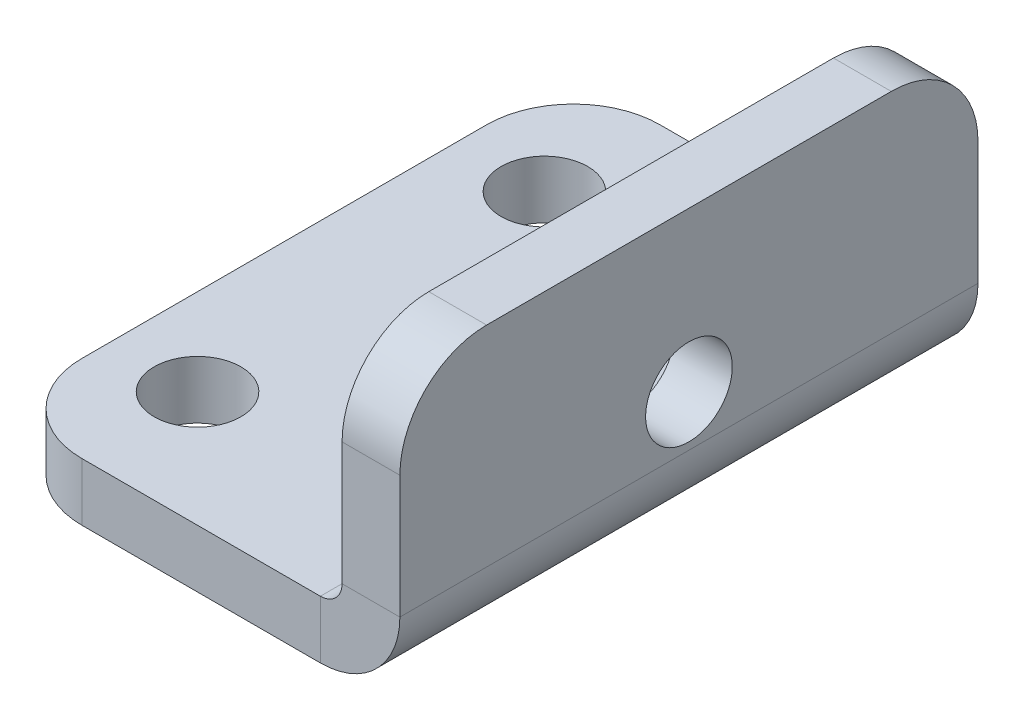
ISO-10303-21;
HEADER;
FILE_DESCRIPTION(('STEP AP214'),'2;1');
FILE_NAME('part.step','',(''),(''),'','','');
FILE_SCHEMA(('AUTOMOTIVE_DESIGN { 1 0 10303 214 1 1 1 1 }'));
ENDSEC;
DATA;
#1=APPLICATION_CONTEXT('core data for automotive mechanical design processes');
#2=APPLICATION_PROTOCOL_DEFINITION('international standard','automotive_design',2000,#1);
#3=PRODUCT_CONTEXT('',#1,'mechanical');
#4=PRODUCT('Part','Part','',(#3));
#5=PRODUCT_RELATED_PRODUCT_CATEGORY('part','',(#4));
#6=PRODUCT_DEFINITION_FORMATION('','',#4);
#7=PRODUCT_DEFINITION_CONTEXT('part definition',#1,'design');
#8=PRODUCT_DEFINITION('design','',#6,#7);
#9=PRODUCT_DEFINITION_SHAPE('','',#8);
#10=(LENGTH_UNIT() NAMED_UNIT(*) SI_UNIT(.MILLI.,.METRE.));
#11=(NAMED_UNIT(*) PLANE_ANGLE_UNIT() SI_UNIT($,.RADIAN.));
#12=(NAMED_UNIT(*) SI_UNIT($,.STERADIAN.) SOLID_ANGLE_UNIT());
#13=UNCERTAINTY_MEASURE_WITH_UNIT(LENGTH_MEASURE(1.E-05),#10,'distance_accuracy_value','');
#14=(GEOMETRIC_REPRESENTATION_CONTEXT(3) GLOBAL_UNCERTAINTY_ASSIGNED_CONTEXT((#13)) GLOBAL_UNIT_ASSIGNED_CONTEXT((#10,
#11,#12)) REPRESENTATION_CONTEXT('',''));
#15=CARTESIAN_POINT('',(0.,0.,0.));
#16=DIRECTION('',(0.,0.,1.));
#17=DIRECTION('',(1.,0.,0.));
#18=AXIS2_PLACEMENT_3D('',#15,#16,#17);
#19=CARTESIAN_POINT('',(-6.93377483443709,-4.90066225165563,7.));
#20=DIRECTION('',(0.,-1.,0.));
#21=DIRECTION('',(0.,0.,-1.));
#22=AXIS2_PLACEMENT_3D('',#19,#20,#21);
#23=CYLINDRICAL_SURFACE('',#22,3.);
#24=CARTESIAN_POINT('',(-6.93377483443709,-4.90066225165563,7.));
#25=DIRECTION('',(0.,-1.,0.));
#26=DIRECTION('',(0.,0.,1.));
#27=AXIS2_PLACEMENT_3D('',#24,#25,#26);
#28=CIRCLE('',#27,3.);
#29=CARTESIAN_POINT('',(-6.93377483443709,-4.90066225165563,10.));
#30=VERTEX_POINT('',#29);
#31=CARTESIAN_POINT('',(-9.93377483443709,-4.90066225165563,7.));
#32=VERTEX_POINT('',#31);
#33=EDGE_CURVE('E269',#30,#32,#28,.T.);
#34=ORIENTED_EDGE('',*,*,#33,.F.);
#35=DIRECTION('',(0.,-1.,0.));
#36=VECTOR('',#35,1.);
#37=CARTESIAN_POINT('',(-6.93377483443709,-4.90066225165563,10.));
#38=LINE('',#37,#36);
#39=CARTESIAN_POINT('',(-6.93377483443709,-2.90066225165563,10.));
#40=VERTEX_POINT('',#39);
#41=EDGE_CURVE('E26',#40,#30,#38,.T.);
#42=ORIENTED_EDGE('',*,*,#41,.F.);
#43=CARTESIAN_POINT('',(-6.93377483443709,-2.90066225165563,7.));
#44=DIRECTION('',(0.,1.,0.));
#45=DIRECTION('',(0.,0.,1.));
#46=AXIS2_PLACEMENT_3D('',#43,#44,#45);
#47=CIRCLE('',#46,3.);
#48=CARTESIAN_POINT('',(-9.93377483443709,-2.90066225165563,7.));
#49=VERTEX_POINT('',#48);
#50=EDGE_CURVE('E294',#49,#40,#47,.T.);
#51=ORIENTED_EDGE('',*,*,#50,.F.);
#52=DIRECTION('',(0.,1.,0.));
#53=VECTOR('',#52,1.);
#54=CARTESIAN_POINT('',(-9.93377483443709,-2.90066225165563,7.));
#55=LINE('',#54,#53);
#56=EDGE_CURVE('E212',#32,#49,#55,.T.);
#57=ORIENTED_EDGE('',*,*,#56,.F.);
#58=EDGE_LOOP('',(#34,#42,#51,#57));
#59=FACE_BOUND('',#58,.T.);
#60=ADVANCED_FACE('F17',(#59),#23,.T.);
#61=CARTESIAN_POINT('',(-6.93377483443709,-2.15066225165563,-7.));
#62=DIRECTION('',(0.,1.,0.));
#63=DIRECTION('',(0.,0.,1.));
#64=AXIS2_PLACEMENT_3D('',#61,#62,#63);
#65=CYLINDRICAL_SURFACE('',#64,3.);
#66=CARTESIAN_POINT('',(-6.93377483443709,-4.90066225165563,-7.));
#67=DIRECTION('',(0.,-1.,0.));
#68=DIRECTION('',(0.,0.,1.));
#69=AXIS2_PLACEMENT_3D('',#66,#67,#68);
#70=CIRCLE('',#69,3.);
#71=CARTESIAN_POINT('',(-9.93377483443709,-4.90066225165563,-7.));
#72=VERTEX_POINT('',#71);
#73=CARTESIAN_POINT('',(-6.93377483443709,-4.90066225165563,-10.));
#74=VERTEX_POINT('',#73);
#75=EDGE_CURVE('E284',#72,#74,#70,.T.);
#76=ORIENTED_EDGE('',*,*,#75,.F.);
#77=DIRECTION('',(0.,-1.,0.));
#78=VECTOR('',#77,1.);
#79=CARTESIAN_POINT('',(-9.93377483443709,-4.90066225165563,-7.));
#80=LINE('',#79,#78);
#81=CARTESIAN_POINT('',(-9.93377483443709,-2.90066225165563,-7.));
#82=VERTEX_POINT('',#81);
#83=EDGE_CURVE('E213',#82,#72,#80,.T.);
#84=ORIENTED_EDGE('',*,*,#83,.F.);
#85=CARTESIAN_POINT('',(-6.93377483443709,-2.90066225165563,-7.));
#86=DIRECTION('',(0.,1.,0.));
#87=DIRECTION('',(0.,0.,1.));
#88=AXIS2_PLACEMENT_3D('',#85,#86,#87);
#89=CIRCLE('',#88,3.);
#90=CARTESIAN_POINT('',(-6.93377483443709,-2.90066225165563,-10.));
#91=VERTEX_POINT('',#90);
#92=EDGE_CURVE('E304',#91,#82,#89,.T.);
#93=ORIENTED_EDGE('',*,*,#92,.F.);
#94=DIRECTION('',(0.,1.,0.));
#95=VECTOR('',#94,1.);
#96=CARTESIAN_POINT('',(-6.93377483443709,-2.15066225165563,-10.));
#97=LINE('',#96,#95);
#98=EDGE_CURVE('E186',#74,#91,#97,.T.);
#99=ORIENTED_EDGE('',*,*,#98,.F.);
#100=EDGE_LOOP('',(#76,#84,#93,#99));
#101=FACE_BOUND('',#100,.T.);
#102=ADVANCED_FACE('F376',(#101),#65,.T.);
#103=CARTESIAN_POINT('',(2.06622516556291,2.09933774834437,7.));
#104=DIRECTION('',(1.,0.,0.));
#105=DIRECTION('',(0.,0.,-1.));
#106=AXIS2_PLACEMENT_3D('',#103,#104,#105);
#107=CYLINDRICAL_SURFACE('',#106,3.);
#108=CARTESIAN_POINT('',(2.06622516556291,2.09933774834437,7.));
#109=DIRECTION('',(-1.,0.,0.));
#110=DIRECTION('',(0.,0.,1.));
#111=AXIS2_PLACEMENT_3D('',#108,#109,#110);
#112=CIRCLE('',#111,3.);
#113=CARTESIAN_POINT('',(2.06622516556291,2.09933774834437,10.));
#114=VERTEX_POINT('',#113);
#115=CARTESIAN_POINT('',(2.06622516556291,5.09933774834437,7.));
#116=VERTEX_POINT('',#115);
#117=EDGE_CURVE('E238',#114,#116,#112,.T.);
#118=ORIENTED_EDGE('',*,*,#117,.F.);
#119=DIRECTION('',(-1.,0.,0.));
#120=VECTOR('',#119,1.);
#121=CARTESIAN_POINT('',(1.31622516556291,2.09933774834437,10.));
#122=LINE('',#121,#120);
#123=CARTESIAN_POINT('',(4.06622516556291,2.09933774834437,10.));
#124=VERTEX_POINT('',#123);
#125=EDGE_CURVE('E253',#124,#114,#122,.T.);
#126=ORIENTED_EDGE('',*,*,#125,.F.);
#127=CARTESIAN_POINT('',(4.06622516556291,2.09933774834437,7.));
#128=DIRECTION('',(1.,0.,0.));
#129=DIRECTION('',(0.,0.,1.));
#130=AXIS2_PLACEMENT_3D('',#127,#128,#129);
#131=CIRCLE('',#130,3.);
#132=CARTESIAN_POINT('',(4.06622516556291,5.09933774834437,7.));
#133=VERTEX_POINT('',#132);
#134=EDGE_CURVE('E176',#133,#124,#131,.T.);
#135=ORIENTED_EDGE('',*,*,#134,.F.);
#136=DIRECTION('',(1.,0.,0.));
#137=VECTOR('',#136,1.);
#138=CARTESIAN_POINT('',(2.06622516556291,5.09933774834437,7.));
#139=LINE('',#138,#137);
#140=EDGE_CURVE('E64',#116,#133,#139,.T.);
#141=ORIENTED_EDGE('',*,*,#140,.F.);
#142=EDGE_LOOP('',(#118,#126,#135,#141));
#143=FACE_BOUND('',#142,.T.);
#144=ADVANCED_FACE('F382',(#143),#107,.T.);
#145=CARTESIAN_POINT('',(1.31622516556291,2.09933774834437,-7.));
#146=DIRECTION('',(1.,0.,0.));
#147=DIRECTION('',(0.,0.,-1.));
#148=AXIS2_PLACEMENT_3D('',#145,#146,#147);
#149=CYLINDRICAL_SURFACE('',#148,3.);
#150=CARTESIAN_POINT('',(2.06622516556291,2.09933774834437,-7.));
#151=DIRECTION('',(-1.,0.,0.));
#152=DIRECTION('',(0.,0.,1.));
#153=AXIS2_PLACEMENT_3D('',#150,#151,#152);
#154=CIRCLE('',#153,3.);
#155=CARTESIAN_POINT('',(2.06622516556291,5.09933774834437,-7.));
#156=VERTEX_POINT('',#155);
#157=CARTESIAN_POINT('',(2.06622516556291,2.09933774834437,-10.));
#158=VERTEX_POINT('',#157);
#159=EDGE_CURVE('E52',#156,#158,#154,.T.);
#160=ORIENTED_EDGE('',*,*,#159,.F.);
#161=DIRECTION('',(-1.,0.,0.));
#162=VECTOR('',#161,1.);
#163=CARTESIAN_POINT('',(2.06622516556291,5.09933774834437,-7.));
#164=LINE('',#163,#162);
#165=CARTESIAN_POINT('',(4.06622516556291,5.09933774834437,-7.));
#166=VERTEX_POINT('',#165);
#167=EDGE_CURVE('E175',#166,#156,#164,.T.);
#168=ORIENTED_EDGE('',*,*,#167,.F.);
#169=CARTESIAN_POINT('',(4.06622516556291,2.09933774834437,-7.));
#170=DIRECTION('',(1.,0.,0.));
#171=DIRECTION('',(0.,0.,1.));
#172=AXIS2_PLACEMENT_3D('',#169,#170,#171);
#173=CIRCLE('',#172,3.);
#174=CARTESIAN_POINT('',(4.06622516556291,2.09933774834437,-10.));
#175=VERTEX_POINT('',#174);
#176=EDGE_CURVE('E185',#175,#166,#173,.T.);
#177=ORIENTED_EDGE('',*,*,#176,.F.);
#178=DIRECTION('',(1.,0.,0.));
#179=VECTOR('',#178,1.);
#180=CARTESIAN_POINT('',(1.31622516556291,2.09933774834437,-10.));
#181=LINE('',#180,#179);
#182=EDGE_CURVE('E11',#158,#175,#181,.T.);
#183=ORIENTED_EDGE('',*,*,#182,.F.);
#184=EDGE_LOOP('',(#160,#168,#177,#183));
#185=FACE_BOUND('',#184,.T.);
#186=ADVANCED_FACE('F415',(#185),#149,.T.);
#187=CARTESIAN_POINT('',(1.31622516556291,-2.15066225165563,-10.));
#188=DIRECTION('',(0.,0.,-1.));
#189=DIRECTION('',(0.,-1.,0.));
#190=AXIS2_PLACEMENT_3D('',#187,#188,#189);
#191=PLANE('',#190);
#192=DIRECTION('',(0.,1.,0.));
#193=VECTOR('',#192,1.);
#194=CARTESIAN_POINT('',(2.06622516556291,-2.90066225165563,-10.));
#195=LINE('',#194,#193);
#196=CARTESIAN_POINT('',(2.06622516556291,-2.15066225165563,-10.));
#197=VERTEX_POINT('',#196);
#198=EDGE_CURVE('E236',#197,#158,#195,.T.);
#199=ORIENTED_EDGE('',*,*,#198,.T.);
#200=ORIENTED_EDGE('',*,*,#182,.T.);
#201=DIRECTION('',(0.,1.,0.));
#202=VECTOR('',#201,1.);
#203=CARTESIAN_POINT('',(4.06622516556291,-2.90066225165563,-10.));
#204=LINE('',#203,#202);
#205=CARTESIAN_POINT('',(4.06622516556291,-2.15066225165563,-10.));
#206=VERTEX_POINT('',#205);
#207=EDGE_CURVE('E168',#206,#175,#204,.T.);
#208=ORIENTED_EDGE('',*,*,#207,.F.);
#209=DIRECTION('',(-1.,0.,0.));
#210=VECTOR('',#209,1.);
#211=CARTESIAN_POINT('',(4.06622516556291,-2.15066225165563,-10.));
#212=LINE('',#211,#210);
#213=EDGE_CURVE('E182',#206,#197,#212,.T.);
#214=ORIENTED_EDGE('',*,*,#213,.T.);
#215=EDGE_LOOP('',(#199,#200,#208,#214));
#216=FACE_BOUND('',#215,.T.);
#217=ADVANCED_FACE('F180',(#216),#191,.T.);
#218=CARTESIAN_POINT('',(1.31622516556291,-2.15066225165563,10.));
#219=DIRECTION('',(0.,0.,-1.));
#220=DIRECTION('',(0.,-1.,0.));
#221=AXIS2_PLACEMENT_3D('',#218,#219,#220);
#222=PLANE('',#221);
#223=DIRECTION('',(1.,0.,0.));
#224=VECTOR('',#223,1.);
#225=CARTESIAN_POINT('',(-9.93377483443709,-2.90066225165563,10.));
#226=LINE('',#225,#224);
#227=CARTESIAN_POINT('',(1.31622516556291,-2.90066225165563,10.));
#228=VERTEX_POINT('',#227);
#229=EDGE_CURVE('E293',#40,#228,#226,.T.);
#230=ORIENTED_EDGE('',*,*,#229,.F.);
#231=ORIENTED_EDGE('',*,*,#41,.T.);
#232=DIRECTION('',(1.,0.,0.));
#233=VECTOR('',#232,1.);
#234=CARTESIAN_POINT('',(-9.93377483443709,-4.90066225165563,10.));
#235=LINE('',#234,#233);
#236=CARTESIAN_POINT('',(1.31622516556291,-4.90066225165563,10.));
#237=VERTEX_POINT('',#236);
#238=EDGE_CURVE('E273',#30,#237,#235,.T.);
#239=ORIENTED_EDGE('',*,*,#238,.T.);
#240=DIRECTION('',(0.,1.,0.));
#241=VECTOR('',#240,1.);
#242=CARTESIAN_POINT('',(1.31622516556291,-4.90066225165563,10.));
#243=LINE('',#242,#241);
#244=EDGE_CURVE('E262',#237,#228,#243,.T.);
#245=ORIENTED_EDGE('',*,*,#244,.T.);
#246=EDGE_LOOP('',(#230,#231,#239,#245));
#247=FACE_BOUND('',#246,.T.);
#248=ADVANCED_FACE('F392',(#247),#222,.F.);
#249=CARTESIAN_POINT('',(1.31622516556291,-2.15066225165563,10.));
#250=DIRECTION('',(0.,0.,-1.));
#251=DIRECTION('',(-1.,0.,0.));
#252=AXIS2_PLACEMENT_3D('',#249,#250,#251);
#253=CYLINDRICAL_SURFACE('',#252,2.75);
#254=CARTESIAN_POINT('',(1.31622516556291,-2.15066225165563,-10.));
#255=DIRECTION('',(0.,0.,1.));
#256=DIRECTION('',(1.,0.,0.));
#257=AXIS2_PLACEMENT_3D('',#254,#255,#256);
#258=CIRCLE('',#257,2.75);
#259=CARTESIAN_POINT('',(1.31622516556291,-4.90066225165563,-10.));
#260=VERTEX_POINT('',#259);
#261=EDGE_CURVE('E189',#260,#206,#258,.T.);
#262=ORIENTED_EDGE('',*,*,#261,.T.);
#263=DIRECTION('',(0.,0.,-1.));
#264=VECTOR('',#263,1.);
#265=CARTESIAN_POINT('',(4.06622516556291,-2.15066225165563,10.));
#266=LINE('',#265,#264);
#267=CARTESIAN_POINT('',(4.06622516556291,-2.15066225165563,10.));
#268=VERTEX_POINT('',#267);
#269=EDGE_CURVE('E164',#268,#206,#266,.T.);
#270=ORIENTED_EDGE('',*,*,#269,.F.);
#271=CARTESIAN_POINT('',(1.31622516556291,-2.15066225165563,10.));
#272=DIRECTION('',(0.,0.,1.));
#273=DIRECTION('',(1.,0.,0.));
#274=AXIS2_PLACEMENT_3D('',#271,#272,#273);
#275=CIRCLE('',#274,2.75);
#276=EDGE_CURVE('E259',#237,#268,#275,.T.);
#277=ORIENTED_EDGE('',*,*,#276,.F.);
#278=DIRECTION('',(0.,0.,-1.));
#279=VECTOR('',#278,1.);
#280=CARTESIAN_POINT('',(1.31622516556291,-4.90066225165563,10.));
#281=LINE('',#280,#279);
#282=EDGE_CURVE('E192',#237,#260,#281,.T.);
#283=ORIENTED_EDGE('',*,*,#282,.T.);
#284=EDGE_LOOP('',(#262,#270,#277,#283));
#285=FACE_BOUND('',#284,.T.);
#286=ADVANCED_FACE('F190',(#285),#253,.T.);
#287=CARTESIAN_POINT('',(-9.93377483443709,-4.90066225165563,10.));
#288=DIRECTION('',(-1.,0.,0.));
#289=DIRECTION('',(0.,0.,1.));
#290=AXIS2_PLACEMENT_3D('',#287,#288,#289);
#291=PLANE('',#290);
#292=DIRECTION('',(0.,0.,-1.));
#293=VECTOR('',#292,1.);
#294=CARTESIAN_POINT('',(-9.93377483443709,-2.90066225165563,10.));
#295=LINE('',#294,#293);
#296=EDGE_CURVE('E298',#49,#82,#295,.T.);
#297=ORIENTED_EDGE('',*,*,#296,.T.);
#298=ORIENTED_EDGE('',*,*,#83,.T.);
#299=DIRECTION('',(0.,0.,-1.));
#300=VECTOR('',#299,1.);
#301=CARTESIAN_POINT('',(-9.93377483443709,-4.90066225165563,10.));
#302=LINE('',#301,#300);
#303=EDGE_CURVE('E288',#32,#72,#302,.T.);
#304=ORIENTED_EDGE('',*,*,#303,.F.);
#305=ORIENTED_EDGE('',*,*,#56,.T.);
#306=EDGE_LOOP('',(#297,#298,#304,#305));
#307=FACE_BOUND('',#306,.T.);
#308=ADVANCED_FACE('F400',(#307),#291,.T.);
#309=CARTESIAN_POINT('',(1.31622516556291,-2.15066225165563,10.));
#310=DIRECTION('',(0.,0.,-1.));
#311=DIRECTION('',(-1.,0.,0.));
#312=AXIS2_PLACEMENT_3D('',#309,#310,#311);
#313=CYLINDRICAL_SURFACE('',#312,0.75);
#314=CARTESIAN_POINT('',(1.31622516556291,-2.15066225165563,-10.));
#315=DIRECTION('',(0.,0.,1.));
#316=DIRECTION('',(-1.,0.,0.));
#317=AXIS2_PLACEMENT_3D('',#314,#315,#316);
#318=CIRCLE('',#317,0.75);
#319=CARTESIAN_POINT('',(1.31622516556291,-2.90066225165563,-10.));
#320=VERTEX_POINT('',#319);
#321=EDGE_CURVE('E200',#320,#197,#318,.T.);
#322=ORIENTED_EDGE('',*,*,#321,.F.);
#323=DIRECTION('',(0.,0.,-1.));
#324=VECTOR('',#323,1.);
#325=CARTESIAN_POINT('',(1.31622516556291,-2.90066225165563,10.));
#326=LINE('',#325,#324);
#327=EDGE_CURVE('E289',#228,#320,#326,.T.);
#328=ORIENTED_EDGE('',*,*,#327,.F.);
#329=CARTESIAN_POINT('',(1.31622516556291,-2.15066225165563,10.));
#330=DIRECTION('',(0.,0.,1.));
#331=DIRECTION('',(-1.,0.,0.));
#332=AXIS2_PLACEMENT_3D('',#329,#330,#331);
#333=CIRCLE('',#332,0.75);
#334=CARTESIAN_POINT('',(2.06622516556291,-2.15066225165563,10.));
#335=VERTEX_POINT('',#334);
#336=EDGE_CURVE('E265',#228,#335,#333,.T.);
#337=ORIENTED_EDGE('',*,*,#336,.T.);
#338=DIRECTION('',(0.,0.,-1.));
#339=VECTOR('',#338,1.);
#340=CARTESIAN_POINT('',(2.06622516556291,-2.15066225165563,10.));
#341=LINE('',#340,#339);
#342=EDGE_CURVE('E157',#335,#197,#341,.T.);
#343=ORIENTED_EDGE('',*,*,#342,.T.);
#344=EDGE_LOOP('',(#322,#328,#337,#343));
#345=FACE_BOUND('',#344,.T.);
#346=ADVANCED_FACE('F406',(#345),#313,.F.);
#347=CARTESIAN_POINT('',(2.06622516556291,-2.90066225165563,10.));
#348=DIRECTION('',(-1.,0.,0.));
#349=DIRECTION('',(0.,0.,1.));
#350=AXIS2_PLACEMENT_3D('',#347,#348,#349);
#351=PLANE('',#350);
#352=CARTESIAN_POINT('',(2.06622516556292,-0.40066225165563,0.));
#353=DIRECTION('',(1.,0.,0.));
#354=DIRECTION('',(0.,0.,-1.));
#355=AXIS2_PLACEMENT_3D('',#352,#353,#354);
#356=CIRCLE('',#355,1.5);
#357=CARTESIAN_POINT('',(2.06622516556291,-0.40066225165563,1.5));
#358=VERTEX_POINT('',#357);
#359=EDGE_CURVE('E338',#358,#358,#356,.T.);
#360=ORIENTED_EDGE('',*,*,#359,.T.);
#361=EDGE_LOOP('',(#360));
#362=FACE_BOUND('',#361,.T.);
#363=DIRECTION('',(0.,0.,-1.));
#364=VECTOR('',#363,1.);
#365=CARTESIAN_POINT('',(2.06622516556291,5.09933774834437,10.));
#366=LINE('',#365,#364);
#367=EDGE_CURVE('E228',#116,#156,#366,.T.);
#368=ORIENTED_EDGE('',*,*,#367,.T.);
#369=ORIENTED_EDGE('',*,*,#159,.T.);
#370=ORIENTED_EDGE('',*,*,#198,.F.);
#371=ORIENTED_EDGE('',*,*,#342,.F.);
#372=DIRECTION('',(0.,1.,0.));
#373=VECTOR('',#372,1.);
#374=CARTESIAN_POINT('',(2.06622516556291,-2.90066225165563,10.));
#375=LINE('',#374,#373);
#376=EDGE_CURVE('E251',#335,#114,#375,.T.);
#377=ORIENTED_EDGE('',*,*,#376,.T.);
#378=ORIENTED_EDGE('',*,*,#117,.T.);
#379=EDGE_LOOP('',(#368,#369,#370,#371,#377,#378));
#380=FACE_BOUND('',#379,.T.);
#381=ADVANCED_FACE('F354',(#362,#380),#351,.T.);
#382=CARTESIAN_POINT('',(2.06622516556291,5.09933774834437,10.));
#383=DIRECTION('',(0.,1.,0.));
#384=DIRECTION('',(1.,0.,0.));
#385=AXIS2_PLACEMENT_3D('',#382,#383,#384);
#386=PLANE('',#385);
#387=DIRECTION('',(0.,0.,-1.));
#388=VECTOR('',#387,1.);
#389=CARTESIAN_POINT('',(4.06622516556291,5.09933774834437,10.));
#390=LINE('',#389,#388);
#391=EDGE_CURVE('E219',#133,#166,#390,.T.);
#392=ORIENTED_EDGE('',*,*,#391,.T.);
#393=ORIENTED_EDGE('',*,*,#167,.T.);
#394=ORIENTED_EDGE('',*,*,#367,.F.);
#395=ORIENTED_EDGE('',*,*,#140,.T.);
#396=EDGE_LOOP('',(#392,#393,#394,#395));
#397=FACE_BOUND('',#396,.T.);
#398=ADVANCED_FACE('F363',(#397),#386,.T.);
#399=CARTESIAN_POINT('',(4.06622516556291,-2.90066225165563,10.));
#400=DIRECTION('',(-1.,0.,0.));
#401=DIRECTION('',(0.,0.,1.));
#402=AXIS2_PLACEMENT_3D('',#399,#400,#401);
#403=PLANE('',#402);
#404=CARTESIAN_POINT('',(4.06622516556292,-0.40066225165563,0.));
#405=DIRECTION('',(-1.,0.,0.));
#406=DIRECTION('',(0.,0.,-1.));
#407=AXIS2_PLACEMENT_3D('',#404,#405,#406);
#408=CIRCLE('',#407,1.5);
#409=CARTESIAN_POINT('',(4.06622516556291,-0.40066225165563,1.5));
#410=VERTEX_POINT('',#409);
#411=EDGE_CURVE('E339',#410,#410,#408,.T.);
#412=ORIENTED_EDGE('',*,*,#411,.T.);
#413=EDGE_LOOP('',(#412));
#414=FACE_BOUND('',#413,.T.);
#415=ORIENTED_EDGE('',*,*,#207,.T.);
#416=ORIENTED_EDGE('',*,*,#176,.T.);
#417=ORIENTED_EDGE('',*,*,#391,.F.);
#418=ORIENTED_EDGE('',*,*,#134,.T.);
#419=DIRECTION('',(0.,1.,0.));
#420=VECTOR('',#419,1.);
#421=CARTESIAN_POINT('',(4.06622516556291,-2.90066225165563,10.));
#422=LINE('',#421,#420);
#423=EDGE_CURVE('E170',#268,#124,#422,.T.);
#424=ORIENTED_EDGE('',*,*,#423,.F.);
#425=ORIENTED_EDGE('',*,*,#269,.T.);
#426=EDGE_LOOP('',(#415,#416,#417,#418,#424,#425));
#427=FACE_BOUND('',#426,.T.);
#428=ADVANCED_FACE('F166',(#414,#427),#403,.F.);
#429=CARTESIAN_POINT('',(4.06622516556291,-2.15066225165563,-10.));
#430=DIRECTION('',(0.,0.,-1.));
#431=DIRECTION('',(0.,-1.,0.));
#432=AXIS2_PLACEMENT_3D('',#429,#430,#431);
#433=PLANE('',#432);
#434=DIRECTION('',(1.,0.,0.));
#435=VECTOR('',#434,1.);
#436=CARTESIAN_POINT('',(-9.93377483443709,-4.90066225165563,-10.));
#437=LINE('',#436,#435);
#438=EDGE_CURVE('E279',#74,#260,#437,.T.);
#439=ORIENTED_EDGE('',*,*,#438,.F.);
#440=ORIENTED_EDGE('',*,*,#98,.T.);
#441=DIRECTION('',(1.,0.,0.));
#442=VECTOR('',#441,1.);
#443=CARTESIAN_POINT('',(-9.93377483443709,-2.90066225165563,-10.));
#444=LINE('',#443,#442);
#445=EDGE_CURVE('E305',#91,#320,#444,.T.);
#446=ORIENTED_EDGE('',*,*,#445,.T.);
#447=DIRECTION('',(0.,-1.,0.));
#448=VECTOR('',#447,1.);
#449=CARTESIAN_POINT('',(1.31622516556291,-2.90066225165563,-10.));
#450=LINE('',#449,#448);
#451=EDGE_CURVE('E207',#320,#260,#450,.T.);
#452=ORIENTED_EDGE('',*,*,#451,.T.);
#453=EDGE_LOOP('',(#439,#440,#446,#452));
#454=FACE_BOUND('',#453,.T.);
#455=ADVANCED_FACE('F362',(#454),#433,.T.);
#456=CARTESIAN_POINT('',(1.31622516556291,-2.90066225165563,-10.));
#457=DIRECTION('',(0.,0.,-1.));
#458=DIRECTION('',(0.,-1.,0.));
#459=AXIS2_PLACEMENT_3D('',#456,#457,#458);
#460=PLANE('',#459);
#461=ORIENTED_EDGE('',*,*,#451,.F.);
#462=ORIENTED_EDGE('',*,*,#321,.T.);
#463=ORIENTED_EDGE('',*,*,#213,.F.);
#464=ORIENTED_EDGE('',*,*,#261,.F.);
#465=EDGE_LOOP('',(#461,#462,#463,#464));
#466=FACE_BOUND('',#465,.T.);
#467=ADVANCED_FACE('F199',(#466),#460,.T.);
#468=CARTESIAN_POINT('',(1.31622516556291,-4.90066225165563,10.));
#469=DIRECTION('',(0.,0.,1.));
#470=DIRECTION('',(1.,0.,0.));
#471=AXIS2_PLACEMENT_3D('',#468,#469,#470);
#472=PLANE('',#471);
#473=ORIENTED_EDGE('',*,*,#423,.T.);
#474=ORIENTED_EDGE('',*,*,#125,.T.);
#475=ORIENTED_EDGE('',*,*,#376,.F.);
#476=DIRECTION('',(1.,0.,0.));
#477=VECTOR('',#476,1.);
#478=CARTESIAN_POINT('',(2.06622516556291,-2.15066225165563,10.));
#479=LINE('',#478,#477);
#480=EDGE_CURVE('E268',#335,#268,#479,.T.);
#481=ORIENTED_EDGE('',*,*,#480,.T.);
#482=EDGE_LOOP('',(#473,#474,#475,#481));
#483=FACE_BOUND('',#482,.T.);
#484=ADVANCED_FACE('F412',(#483),#472,.T.);
#485=CARTESIAN_POINT('',(2.06622516556291,-2.15066225165563,10.));
#486=DIRECTION('',(0.,0.,1.));
#487=DIRECTION('',(1.,0.,0.));
#488=AXIS2_PLACEMENT_3D('',#485,#486,#487);
#489=PLANE('',#488);
#490=ORIENTED_EDGE('',*,*,#480,.F.);
#491=ORIENTED_EDGE('',*,*,#336,.F.);
#492=ORIENTED_EDGE('',*,*,#244,.F.);
#493=ORIENTED_EDGE('',*,*,#276,.T.);
#494=EDGE_LOOP('',(#490,#491,#492,#493));
#495=FACE_BOUND('',#494,.T.);
#496=ADVANCED_FACE('F409',(#495),#489,.T.);
#497=CARTESIAN_POINT('',(-9.93377483443709,-4.90066225165563,10.));
#498=DIRECTION('',(0.,1.,0.));
#499=DIRECTION('',(1.,0.,0.));
#500=AXIS2_PLACEMENT_3D('',#497,#498,#499);
#501=PLANE('',#500);
#502=CARTESIAN_POINT('',(-6.93377483443709,-4.90066225165563,-6.));
#503=DIRECTION('',(0.,1.,0.));
#504=DIRECTION('',(0.,0.,1.));
#505=AXIS2_PLACEMENT_3D('',#502,#503,#504);
#506=CIRCLE('',#505,1.5);
#507=CARTESIAN_POINT('',(-6.93377483443709,-4.90066225165563,-7.5));
#508=VERTEX_POINT('',#507);
#509=EDGE_CURVE('E331',#508,#508,#506,.T.);
#510=ORIENTED_EDGE('',*,*,#509,.T.);
#511=EDGE_LOOP('',(#510));
#512=FACE_BOUND('',#511,.T.);
#513=CARTESIAN_POINT('',(-6.93377483443709,-4.90066225165563,6.));
#514=DIRECTION('',(0.,-1.,0.));
#515=DIRECTION('',(0.,0.,1.));
#516=AXIS2_PLACEMENT_3D('',#513,#514,#515);
#517=CIRCLE('',#516,1.5);
#518=CARTESIAN_POINT('',(-6.93377483443709,-4.90066225165563,4.5));
#519=VERTEX_POINT('',#518);
#520=EDGE_CURVE('E317',#519,#519,#517,.T.);
#521=ORIENTED_EDGE('',*,*,#520,.F.);
#522=EDGE_LOOP('',(#521));
#523=FACE_BOUND('',#522,.T.);
#524=ORIENTED_EDGE('',*,*,#303,.T.);
#525=ORIENTED_EDGE('',*,*,#75,.T.);
#526=ORIENTED_EDGE('',*,*,#438,.T.);
#527=ORIENTED_EDGE('',*,*,#282,.F.);
#528=ORIENTED_EDGE('',*,*,#238,.F.);
#529=ORIENTED_EDGE('',*,*,#33,.T.);
#530=EDGE_LOOP('',(#524,#525,#526,#527,#528,#529));
#531=FACE_BOUND('',#530,.T.);
#532=ADVANCED_FACE('F390',(#512,#523,#531),#501,.F.);
#533=CARTESIAN_POINT('',(-9.93377483443709,-2.90066225165563,10.));
#534=DIRECTION('',(0.,1.,0.));
#535=DIRECTION('',(1.,0.,0.));
#536=AXIS2_PLACEMENT_3D('',#533,#534,#535);
#537=PLANE('',#536);
#538=CARTESIAN_POINT('',(-6.93377483443709,-2.90066225165563,6.));
#539=DIRECTION('',(0.,-1.,0.));
#540=DIRECTION('',(0.,0.,-1.));
#541=AXIS2_PLACEMENT_3D('',#538,#539,#540);
#542=CIRCLE('',#541,1.5);
#543=CARTESIAN_POINT('',(-6.93377483443709,-2.90066225165563,4.5));
#544=VERTEX_POINT('',#543);
#545=EDGE_CURVE('E309',#544,#544,#542,.T.);
#546=ORIENTED_EDGE('',*,*,#545,.T.);
#547=EDGE_LOOP('',(#546));
#548=FACE_BOUND('',#547,.T.);
#549=CARTESIAN_POINT('',(-6.93377483443709,-2.90066225165563,-6.));
#550=DIRECTION('',(0.,1.,0.));
#551=DIRECTION('',(0.,0.,1.));
#552=AXIS2_PLACEMENT_3D('',#549,#550,#551);
#553=CIRCLE('',#552,1.5);
#554=CARTESIAN_POINT('',(-6.93377483443709,-2.90066225165563,-7.5));
#555=VERTEX_POINT('',#554);
#556=EDGE_CURVE('E321',#555,#555,#553,.T.);
#557=ORIENTED_EDGE('',*,*,#556,.F.);
#558=EDGE_LOOP('',(#557));
#559=FACE_BOUND('',#558,.T.);
#560=ORIENTED_EDGE('',*,*,#445,.F.);
#561=ORIENTED_EDGE('',*,*,#92,.T.);
#562=ORIENTED_EDGE('',*,*,#296,.F.);
#563=ORIENTED_EDGE('',*,*,#50,.T.);
#564=ORIENTED_EDGE('',*,*,#229,.T.);
#565=ORIENTED_EDGE('',*,*,#327,.T.);
#566=EDGE_LOOP('',(#560,#561,#562,#563,#564,#565));
#567=FACE_BOUND('',#566,.T.);
#568=ADVANCED_FACE('F398',(#548,#559,#567),#537,.T.);
#569=CARTESIAN_POINT('',(-6.93377483443709,-12.9006622516556,6.));
#570=DIRECTION('',(0.,1.,0.));
#571=DIRECTION('',(0.,0.,1.));
#572=AXIS2_PLACEMENT_3D('',#569,#570,#571);
#573=CYLINDRICAL_SURFACE('',#572,1.5);
#574=ORIENTED_EDGE('',*,*,#520,.T.);
#575=DIRECTION('',(0.,1.,0.));
#576=VECTOR('',#575,1.);
#577=CARTESIAN_POINT('',(-6.93377483443709,-12.9006622516556,4.5));
#578=LINE('',#577,#576);
#579=EDGE_CURVE('E313',#519,#544,#578,.T.);
#580=ORIENTED_EDGE('',*,*,#579,.T.);
#581=ORIENTED_EDGE('',*,*,#545,.F.);
#582=ORIENTED_EDGE('',*,*,#579,.F.);
#583=EDGE_LOOP('',(#574,#580,#581,#582));
#584=FACE_BOUND('',#583,.T.);
#585=ADVANCED_FACE('F482',(#584),#573,.F.);
#586=CARTESIAN_POINT('',(-6.93377483443709,-12.9006622516556,-6.));
#587=DIRECTION('',(0.,1.,0.));
#588=DIRECTION('',(0.,0.,1.));
#589=AXIS2_PLACEMENT_3D('',#586,#587,#588);
#590=CYLINDRICAL_SURFACE('',#589,1.5);
#591=ORIENTED_EDGE('',*,*,#509,.F.);
#592=DIRECTION('',(0.,1.,0.));
#593=VECTOR('',#592,1.);
#594=CARTESIAN_POINT('',(-6.93377483443709,-12.9006622516556,-7.5));
#595=LINE('',#594,#593);
#596=EDGE_CURVE('E327',#508,#555,#595,.T.);
#597=ORIENTED_EDGE('',*,*,#596,.T.);
#598=ORIENTED_EDGE('',*,*,#556,.T.);
#599=ORIENTED_EDGE('',*,*,#596,.F.);
#600=EDGE_LOOP('',(#591,#597,#598,#599));
#601=FACE_BOUND('',#600,.T.);
#602=ADVANCED_FACE('F490',(#601),#590,.F.);
#603=CARTESIAN_POINT('',(4.06622516556291,-0.40066225165563,0.));
#604=DIRECTION('',(-1.,0.,0.));
#605=DIRECTION('',(0.,0.,-1.));
#606=AXIS2_PLACEMENT_3D('',#603,#604,#605);
#607=CYLINDRICAL_SURFACE('',#606,1.5);
#608=ORIENTED_EDGE('',*,*,#411,.F.);
#609=DIRECTION('',(-1.,0.,0.));
#610=VECTOR('',#609,1.);
#611=CARTESIAN_POINT('',(4.06622516556291,-0.40066225165563,1.5));
#612=LINE('',#611,#610);
#613=EDGE_CURVE('E334',#410,#358,#612,.T.);
#614=ORIENTED_EDGE('',*,*,#613,.T.);
#615=ORIENTED_EDGE('',*,*,#359,.F.);
#616=ORIENTED_EDGE('',*,*,#613,.F.);
#617=EDGE_LOOP('',(#608,#614,#615,#616));
#618=FACE_BOUND('',#617,.T.);
#619=ADVANCED_FACE('F359',(#618),#607,.F.);
#620=CLOSED_SHELL('',(#60,#102,#144,#186,#217,#248,#286,#308,#346,#381,#398,#428,#455,#467,#484,
#496,#532,#568,#585,#602,#619));
#621=MANIFOLD_SOLID_BREP('B1',#620);
#622=ADVANCED_BREP_SHAPE_REPRESENTATION('',(#18,#621),#14);
#623=SHAPE_DEFINITION_REPRESENTATION(#9,#622);
ENDSEC;
END-ISO-10303-21;
